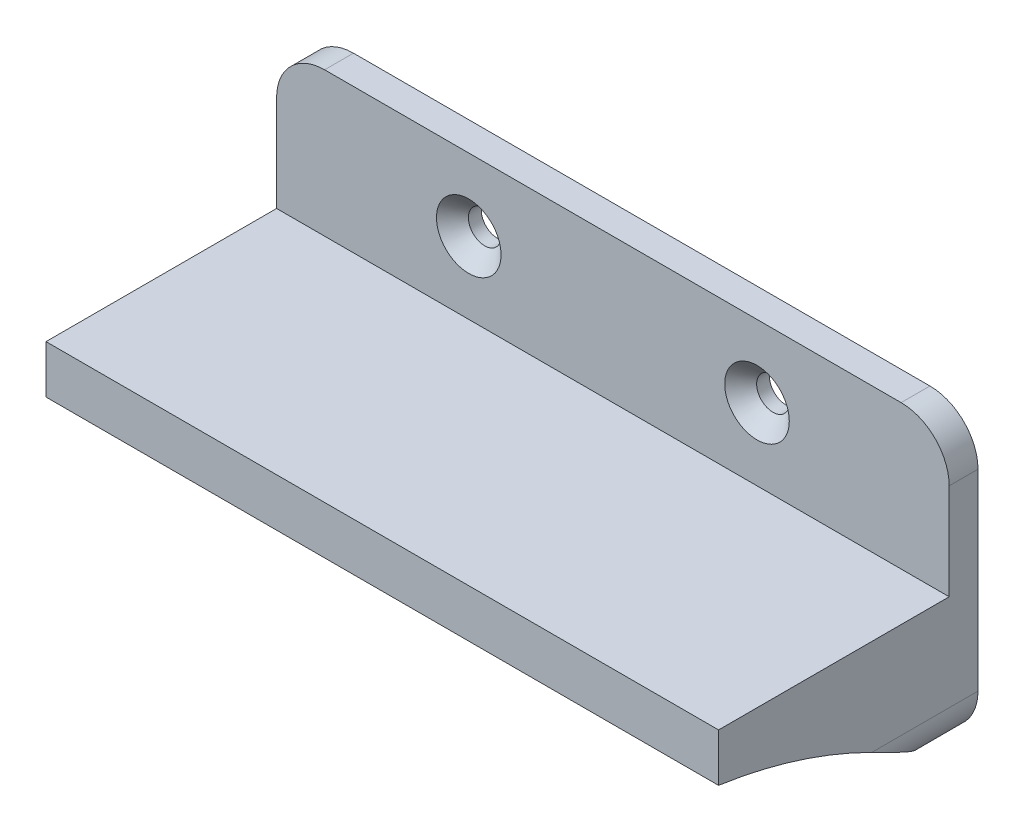
ISO-10303-21;
HEADER;
FILE_DESCRIPTION(('STEP AP214'),'2;1');
FILE_NAME('part.step','',(''),(''),'','','');
FILE_SCHEMA(('AUTOMOTIVE_DESIGN { 1 0 10303 214 1 1 1 1 }'));
ENDSEC;
DATA;
#1=APPLICATION_CONTEXT('core data for automotive mechanical design processes');
#2=APPLICATION_PROTOCOL_DEFINITION('international standard','automotive_design',2000,#1);
#3=PRODUCT_CONTEXT('',#1,'mechanical');
#4=PRODUCT('Part','Part','',(#3));
#5=PRODUCT_RELATED_PRODUCT_CATEGORY('part','',(#4));
#6=PRODUCT_DEFINITION_FORMATION('','',#4);
#7=PRODUCT_DEFINITION_CONTEXT('part definition',#1,'design');
#8=PRODUCT_DEFINITION('design','',#6,#7);
#9=PRODUCT_DEFINITION_SHAPE('','',#8);
#10=(LENGTH_UNIT() NAMED_UNIT(*) SI_UNIT(.MILLI.,.METRE.));
#11=(NAMED_UNIT(*) PLANE_ANGLE_UNIT() SI_UNIT($,.RADIAN.));
#12=(NAMED_UNIT(*) SI_UNIT($,.STERADIAN.) SOLID_ANGLE_UNIT());
#13=UNCERTAINTY_MEASURE_WITH_UNIT(LENGTH_MEASURE(1.E-05),#10,'distance_accuracy_value','');
#14=(GEOMETRIC_REPRESENTATION_CONTEXT(3) GLOBAL_UNCERTAINTY_ASSIGNED_CONTEXT((#13)) GLOBAL_UNIT_ASSIGNED_CONTEXT((#10,
#11,#12)) REPRESENTATION_CONTEXT('',''));
#15=CARTESIAN_POINT('',(0.,0.,0.));
#16=DIRECTION('',(0.,0.,1.));
#17=DIRECTION('',(1.,0.,0.));
#18=AXIS2_PLACEMENT_3D('',#15,#16,#17);
#19=CARTESIAN_POINT('',(0.,0.,3.));
#20=DIRECTION('',(0.,0.,1.));
#21=DIRECTION('',(1.,0.,0.));
#22=AXIS2_PLACEMENT_3D('',#19,#20,#21);
#23=PLANE('',#22);
#24=CARTESIAN_POINT('',(-9.92366412213741,7.99618320610687,3.));
#25=DIRECTION('',(0.,0.,1.));
#26=DIRECTION('',(1.,0.,0.));
#27=AXIS2_PLACEMENT_3D('',#24,#25,#26);
#28=CIRCLE('',#27,3.36);
#29=CARTESIAN_POINT('',(-6.56366412213741,7.99618320610687,3.));
#30=VERTEX_POINT('',#29);
#31=EDGE_CURVE('E479',#30,#30,#28,.T.);
#32=ORIENTED_EDGE('',*,*,#31,.F.);
#33=EDGE_LOOP('',(#32));
#34=FACE_BOUND('',#33,.T.);
#35=CARTESIAN_POINT('',(20.0763358778626,7.99618320610689,3.));
#36=DIRECTION('',(0.,0.,1.));
#37=DIRECTION('',(1.,0.,0.));
#38=AXIS2_PLACEMENT_3D('',#35,#36,#37);
#39=CIRCLE('',#38,3.36);
#40=CARTESIAN_POINT('',(23.4363358778626,7.99618320610689,3.));
#41=VERTEX_POINT('',#40);
#42=EDGE_CURVE('E470',#41,#41,#39,.T.);
#43=ORIENTED_EDGE('',*,*,#42,.F.);
#44=EDGE_LOOP('',(#43));
#45=FACE_BOUND('',#44,.T.);
#46=DIRECTION('',(0.,1.,0.));
#47=VECTOR('',#46,1.);
#48=CARTESIAN_POINT('',(40.0763358778626,15.4961832061069,3.));
#49=LINE('',#48,#47);
#50=CARTESIAN_POINT('',(40.0763358778626,0.496183206106872,3.));
#51=VERTEX_POINT('',#50);
#52=CARTESIAN_POINT('',(40.0763358778626,10.4961832061069,3.));
#53=VERTEX_POINT('',#52);
#54=EDGE_CURVE('E283',#51,#53,#49,.T.);
#55=ORIENTED_EDGE('',*,*,#54,.T.);
#56=CARTESIAN_POINT('',(35.0763358778626,10.4961832061069,3.));
#57=DIRECTION('',(0.,0.,1.));
#58=DIRECTION('',(1.,0.,0.));
#59=AXIS2_PLACEMENT_3D('',#56,#57,#58);
#60=CIRCLE('',#59,5.);
#61=CARTESIAN_POINT('',(35.0763358778626,15.4961832061069,3.));
#62=VERTEX_POINT('',#61);
#63=EDGE_CURVE('E11',#53,#62,#60,.T.);
#64=ORIENTED_EDGE('',*,*,#63,.T.);
#65=DIRECTION('',(-1.,0.,0.));
#66=VECTOR('',#65,1.);
#67=CARTESIAN_POINT('',(-29.9236641221374,15.4961832061069,3.));
#68=LINE('',#67,#66);
#69=CARTESIAN_POINT('',(-24.9236641221374,15.4961832061069,3.));
#70=VERTEX_POINT('',#69);
#71=EDGE_CURVE('E188',#62,#70,#68,.T.);
#72=ORIENTED_EDGE('',*,*,#71,.T.);
#73=CARTESIAN_POINT('',(-24.9236641221374,10.4961832061069,3.));
#74=DIRECTION('',(0.,0.,1.));
#75=DIRECTION('',(1.,0.,0.));
#76=AXIS2_PLACEMENT_3D('',#73,#74,#75);
#77=CIRCLE('',#76,5.);
#78=CARTESIAN_POINT('',(-29.9236641221374,10.4961832061069,3.));
#79=VERTEX_POINT('',#78);
#80=EDGE_CURVE('E41',#70,#79,#77,.T.);
#81=ORIENTED_EDGE('',*,*,#80,.T.);
#82=DIRECTION('',(0.,-1.,0.));
#83=VECTOR('',#82,1.);
#84=CARTESIAN_POINT('',(-29.9236641221374,15.4961832061069,3.));
#85=LINE('',#84,#83);
#86=CARTESIAN_POINT('',(-29.9236641221374,0.496183206106872,3.));
#87=VERTEX_POINT('',#86);
#88=EDGE_CURVE('E275',#79,#87,#85,.T.);
#89=ORIENTED_EDGE('',*,*,#88,.T.);
#90=DIRECTION('',(-1.,0.,0.));
#91=VECTOR('',#90,1.);
#92=CARTESIAN_POINT('',(-29.9236641221374,0.496183206106873,3.));
#93=LINE('',#92,#91);
#94=EDGE_CURVE('E208',#51,#87,#93,.T.);
#95=ORIENTED_EDGE('',*,*,#94,.F.);
#96=EDGE_LOOP('',(#55,#64,#72,#81,#89,#95));
#97=FACE_BOUND('',#96,.T.);
#98=ADVANCED_FACE('F33',(#34,#45,#97),#23,.T.);
#99=CARTESIAN_POINT('',(27.0763358778626,-9.50381679389311,3.));
#100=DIRECTION('',(0.,0.,1.));
#101=DIRECTION('',(1.,0.,0.));
#102=AXIS2_PLACEMENT_3D('',#99,#100,#101);
#103=CIRCLE('',#102,3.36);
#104=CARTESIAN_POINT('',(30.4363358778626,-9.50381679389311,3.));
#105=VERTEX_POINT('',#104);
#106=EDGE_CURVE('E452',#105,#105,#103,.T.);
#107=ORIENTED_EDGE('',*,*,#106,.F.);
#108=EDGE_LOOP('',(#107));
#109=FACE_BOUND('',#108,.T.);
#110=DIRECTION('',(1.,0.,0.));
#111=VECTOR('',#110,1.);
#112=CARTESIAN_POINT('',(-29.9236641221374,-14.5038167938931,3.));
#113=LINE('',#112,#111);
#114=CARTESIAN_POINT('',(18.0763358778626,-14.5038167938931,3.00000000000001));
#115=VERTEX_POINT('',#114);
#116=CARTESIAN_POINT('',(35.0763358778626,-14.5038167938931,3.));
#117=VERTEX_POINT('',#116);
#118=EDGE_CURVE('E277',#115,#117,#113,.T.);
#119=ORIENTED_EDGE('',*,*,#118,.T.);
#120=CARTESIAN_POINT('',(35.0763358778626,-9.50381679389312,3.));
#121=DIRECTION('',(0.,0.,1.));
#122=DIRECTION('',(1.,0.,0.));
#123=AXIS2_PLACEMENT_3D('',#120,#121,#122);
#124=CIRCLE('',#123,5.);
#125=CARTESIAN_POINT('',(36.0763358778626,-14.4027962794595,3.));
#126=VERTEX_POINT('',#125);
#127=EDGE_CURVE('E312',#117,#126,#124,.T.);
#128=ORIENTED_EDGE('',*,*,#127,.T.);
#129=DIRECTION('',(0.,-1.,0.));
#130=VECTOR('',#129,1.);
#131=CARTESIAN_POINT('',(36.0763358778626,-4.50381679389313,3.));
#132=LINE('',#131,#130);
#133=CARTESIAN_POINT('',(36.0763358778626,-4.50381679389313,3.));
#134=VERTEX_POINT('',#133);
#135=EDGE_CURVE('E213',#134,#126,#132,.T.);
#136=ORIENTED_EDGE('',*,*,#135,.F.);
#137=DIRECTION('',(1.,0.,0.));
#138=VECTOR('',#137,1.);
#139=CARTESIAN_POINT('',(18.0763358778626,-4.50381679389313,3.));
#140=LINE('',#139,#138);
#141=CARTESIAN_POINT('',(18.0763358778626,-4.50381679389313,3.));
#142=VERTEX_POINT('',#141);
#143=EDGE_CURVE('E247',#142,#134,#140,.T.);
#144=ORIENTED_EDGE('',*,*,#143,.F.);
#145=DIRECTION('',(0.,1.,0.));
#146=VECTOR('',#145,1.);
#147=CARTESIAN_POINT('',(18.0763358778626,-4.50381679389313,3.));
#148=LINE('',#147,#146);
#149=EDGE_CURVE('E244',#115,#142,#148,.T.);
#150=ORIENTED_EDGE('',*,*,#149,.F.);
#151=EDGE_LOOP('',(#119,#128,#136,#144,#150));
#152=FACE_BOUND('',#151,.T.);
#153=ADVANCED_FACE('F361',(#109,#152),#23,.T.);
#154=DIRECTION('',(0.,-1.,0.));
#155=VECTOR('',#154,1.);
#156=CARTESIAN_POINT('',(14.0763358778626,-4.50381679389313,3.));
#157=LINE('',#156,#155);
#158=CARTESIAN_POINT('',(14.0763358778626,-4.50381679389313,3.));
#159=VERTEX_POINT('',#158);
#160=CARTESIAN_POINT('',(14.0763358778626,-14.5038167938931,3.00000000000001));
#161=VERTEX_POINT('',#160);
#162=EDGE_CURVE('E241',#159,#161,#157,.T.);
#163=ORIENTED_EDGE('',*,*,#162,.F.);
#164=DIRECTION('',(1.,0.,0.));
#165=VECTOR('',#164,1.);
#166=CARTESIAN_POINT('',(-3.92366412213741,-4.50381679389313,3.));
#167=LINE('',#166,#165);
#168=CARTESIAN_POINT('',(-3.92366412213741,-4.50381679389313,3.));
#169=VERTEX_POINT('',#168);
#170=EDGE_CURVE('E238',#169,#159,#167,.T.);
#171=ORIENTED_EDGE('',*,*,#170,.F.);
#172=DIRECTION('',(0.,1.,0.));
#173=VECTOR('',#172,1.);
#174=CARTESIAN_POINT('',(-3.92366412213741,-4.50381679389313,3.));
#175=LINE('',#174,#173);
#176=CARTESIAN_POINT('',(-3.92366412213741,-14.5038167938931,3.00000000000001));
#177=VERTEX_POINT('',#176);
#178=EDGE_CURVE('E235',#177,#169,#175,.T.);
#179=ORIENTED_EDGE('',*,*,#178,.F.);
#180=EDGE_CURVE('E281',#177,#161,#113,.T.);
#181=ORIENTED_EDGE('',*,*,#180,.T.);
#182=EDGE_LOOP('',(#163,#171,#179,#181));
#183=FACE_BOUND('',#182,.T.);
#184=ADVANCED_FACE('F368',(#183),#23,.T.);
#185=CARTESIAN_POINT('',(-29.9236641221374,15.4961832061069,3.));
#186=DIRECTION('',(1.,0.,0.));
#187=DIRECTION('',(0.,0.,-1.));
#188=AXIS2_PLACEMENT_3D('',#185,#186,#187);
#189=PLANE('',#188);
#190=DIRECTION('',(0.,-1.,0.));
#191=VECTOR('',#190,1.);
#192=CARTESIAN_POINT('',(-29.9236641221374,15.4961832061069,0.));
#193=LINE('',#192,#191);
#194=CARTESIAN_POINT('',(-29.9236641221374,10.4961832061069,0.));
#195=VERTEX_POINT('',#194);
#196=CARTESIAN_POINT('',(-29.9236641221374,-9.50381679389313,0.));
#197=VERTEX_POINT('',#196);
#198=EDGE_CURVE('E274',#195,#197,#193,.T.);
#199=ORIENTED_EDGE('',*,*,#198,.T.);
#200=DIRECTION('',(0.,0.,-1.));
#201=VECTOR('',#200,1.);
#202=CARTESIAN_POINT('',(-29.9236641221374,-9.50381679389313,3.));
#203=LINE('',#202,#201);
#204=CARTESIAN_POINT('',(-29.9236641221374,-9.50381679389313,11.0521277313624));
#205=VERTEX_POINT('',#204);
#206=EDGE_CURVE('E198',#197,#205,#203,.F.);
#207=ORIENTED_EDGE('',*,*,#206,.T.);
#208=CARTESIAN_POINT('',(-29.9236641221374,-56.1358132044966,34.4299985044181));
#209=DIRECTION('',(-1.,0.,0.));
#210=DIRECTION('',(0.,0.,-1.));
#211=AXIS2_PLACEMENT_3D('',#208,#209,#210);
#212=CIRCLE('',#211,52.1638565591179);
#213=CARTESIAN_POINT('',(-29.9236641221374,-4.50381679389313,27.));
#214=VERTEX_POINT('',#213);
#215=EDGE_CURVE('E179',#214,#205,#212,.T.);
#216=ORIENTED_EDGE('',*,*,#215,.F.);
#217=DIRECTION('',(0.,-1.,0.));
#218=VECTOR('',#217,1.);
#219=CARTESIAN_POINT('',(-29.9236641221374,0.496183206106873,27.));
#220=LINE('',#219,#218);
#221=CARTESIAN_POINT('',(-29.9236641221374,0.496183206106873,27.));
#222=VERTEX_POINT('',#221);
#223=EDGE_CURVE('E196',#222,#214,#220,.T.);
#224=ORIENTED_EDGE('',*,*,#223,.F.);
#225=DIRECTION('',(0.,0.,-1.));
#226=VECTOR('',#225,1.);
#227=CARTESIAN_POINT('',(-29.9236641221374,0.496183206106873,27.));
#228=LINE('',#227,#226);
#229=EDGE_CURVE('E226',#222,#87,#228,.T.);
#230=ORIENTED_EDGE('',*,*,#229,.T.);
#231=ORIENTED_EDGE('',*,*,#88,.F.);
#232=DIRECTION('',(0.,0.,-1.));
#233=VECTOR('',#232,1.);
#234=CARTESIAN_POINT('',(-29.9236641221374,10.4961832061069,3.));
#235=LINE('',#234,#233);
#236=EDGE_CURVE('E324',#79,#195,#235,.T.);
#237=ORIENTED_EDGE('',*,*,#236,.T.);
#238=EDGE_LOOP('',(#199,#207,#216,#224,#230,#231,#237));
#239=FACE_BOUND('',#238,.T.);
#240=ADVANCED_FACE('F194',(#239),#189,.F.);
#241=CARTESIAN_POINT('',(-29.9236641221374,-14.5038167938931,3.));
#242=DIRECTION('',(0.,1.,0.));
#243=DIRECTION('',(0.,0.,1.));
#244=AXIS2_PLACEMENT_3D('',#241,#242,#243);
#245=PLANE('',#244);
#246=DIRECTION('',(1.,0.,0.));
#247=VECTOR('',#246,1.);
#248=CARTESIAN_POINT('',(-29.9236641221374,-14.5038167938931,0.));
#249=LINE('',#248,#247);
#250=CARTESIAN_POINT('',(-24.9236641221374,-14.5038167938931,0.));
#251=VERTEX_POINT('',#250);
#252=CARTESIAN_POINT('',(35.0763358778626,-14.5038167938931,0.));
#253=VERTEX_POINT('',#252);
#254=EDGE_CURVE('E287',#251,#253,#249,.T.);
#255=ORIENTED_EDGE('',*,*,#254,.T.);
#256=DIRECTION('',(0.,0.,-1.));
#257=VECTOR('',#256,1.);
#258=CARTESIAN_POINT('',(35.0763358778626,-14.5038167938931,3.));
#259=LINE('',#258,#257);
#260=EDGE_CURVE('E310',#253,#117,#259,.F.);
#261=ORIENTED_EDGE('',*,*,#260,.T.);
#262=ORIENTED_EDGE('',*,*,#118,.F.);
#263=DIRECTION('',(-1.,0.,0.));
#264=VECTOR('',#263,1.);
#265=CARTESIAN_POINT('',(40.0763358778626,-14.5038167938931,3.00000000000001));
#266=LINE('',#265,#264);
#267=EDGE_CURVE('E427',#115,#161,#266,.T.);
#268=ORIENTED_EDGE('',*,*,#267,.T.);
#269=ORIENTED_EDGE('',*,*,#180,.F.);
#270=CARTESIAN_POINT('',(-7.92366412213741,-14.5038167938931,3.00000000000001));
#271=VERTEX_POINT('',#270);
#272=EDGE_CURVE('E425',#177,#271,#266,.T.);
#273=ORIENTED_EDGE('',*,*,#272,.T.);
#274=CARTESIAN_POINT('',(-24.9236641221374,-14.5038167938931,3.));
#275=VERTEX_POINT('',#274);
#276=EDGE_CURVE('E282',#275,#271,#113,.T.);
#277=ORIENTED_EDGE('',*,*,#276,.F.);
#278=DIRECTION('',(0.,0.,-1.));
#279=VECTOR('',#278,1.);
#280=CARTESIAN_POINT('',(-24.9236641221374,-14.5038167938931,3.));
#281=LINE('',#280,#279);
#282=EDGE_CURVE('E307',#275,#251,#281,.T.);
#283=ORIENTED_EDGE('',*,*,#282,.T.);
#284=EDGE_LOOP('',(#255,#261,#262,#268,#269,#273,#277,#283));
#285=FACE_BOUND('',#284,.T.);
#286=ADVANCED_FACE('F393',(#285),#245,.F.);
#287=CARTESIAN_POINT('',(40.0763358778626,15.4961832061069,3.));
#288=DIRECTION('',(-1.,0.,0.));
#289=DIRECTION('',(0.,-1.,0.));
#290=AXIS2_PLACEMENT_3D('',#287,#288,#289);
#291=PLANE('',#290);
#292=CARTESIAN_POINT('',(40.0763358778626,-56.1358132044966,34.4299985044181));
#293=DIRECTION('',(-1.,0.,0.));
#294=DIRECTION('',(0.,0.,-1.));
#295=AXIS2_PLACEMENT_3D('',#292,#293,#294);
#296=CIRCLE('',#295,52.1638565591179);
#297=CARTESIAN_POINT('',(40.0763358778626,-4.50381679389313,27.));
#298=VERTEX_POINT('',#297);
#299=CARTESIAN_POINT('',(40.0763358778626,-9.50381679389312,11.0521277313625));
#300=VERTEX_POINT('',#299);
#301=EDGE_CURVE('E199',#298,#300,#296,.T.);
#302=ORIENTED_EDGE('',*,*,#301,.T.);
#303=DIRECTION('',(0.,0.,-1.));
#304=VECTOR('',#303,1.);
#305=CARTESIAN_POINT('',(40.0763358778626,-9.50381679389312,3.));
#306=LINE('',#305,#304);
#307=CARTESIAN_POINT('',(40.0763358778626,-9.50381679389312,0.));
#308=VERTEX_POINT('',#307);
#309=EDGE_CURVE('E296',#300,#308,#306,.T.);
#310=ORIENTED_EDGE('',*,*,#309,.T.);
#311=DIRECTION('',(0.,1.,0.));
#312=VECTOR('',#311,1.);
#313=CARTESIAN_POINT('',(40.0763358778626,15.4961832061069,0.));
#314=LINE('',#313,#312);
#315=CARTESIAN_POINT('',(40.0763358778626,10.4961832061069,0.));
#316=VERTEX_POINT('',#315);
#317=EDGE_CURVE('E290',#308,#316,#314,.T.);
#318=ORIENTED_EDGE('',*,*,#317,.T.);
#319=DIRECTION('',(0.,0.,-1.));
#320=VECTOR('',#319,1.);
#321=CARTESIAN_POINT('',(40.0763358778626,10.4961832061069,3.));
#322=LINE('',#321,#320);
#323=EDGE_CURVE('E294',#316,#53,#322,.F.);
#324=ORIENTED_EDGE('',*,*,#323,.T.);
#325=ORIENTED_EDGE('',*,*,#54,.F.);
#326=DIRECTION('',(0.,0.,-1.));
#327=VECTOR('',#326,1.);
#328=CARTESIAN_POINT('',(40.0763358778626,0.496183206106873,27.));
#329=LINE('',#328,#327);
#330=CARTESIAN_POINT('',(40.0763358778626,0.496183206106873,27.));
#331=VERTEX_POINT('',#330);
#332=EDGE_CURVE('E253',#331,#51,#329,.T.);
#333=ORIENTED_EDGE('',*,*,#332,.F.);
#334=DIRECTION('',(0.,1.,0.));
#335=VECTOR('',#334,1.);
#336=CARTESIAN_POINT('',(40.0763358778626,-4.50381679389313,27.));
#337=LINE('',#336,#335);
#338=EDGE_CURVE('E223',#298,#331,#337,.T.);
#339=ORIENTED_EDGE('',*,*,#338,.F.);
#340=EDGE_LOOP('',(#302,#310,#318,#324,#325,#333,#339));
#341=FACE_BOUND('',#340,.T.);
#342=ADVANCED_FACE('F384',(#341),#291,.F.);
#343=CARTESIAN_POINT('',(-29.9236641221374,15.4961832061069,3.));
#344=DIRECTION('',(0.,-1.,0.));
#345=DIRECTION('',(0.,0.,-1.));
#346=AXIS2_PLACEMENT_3D('',#343,#344,#345);
#347=PLANE('',#346);
#348=ORIENTED_EDGE('',*,*,#71,.F.);
#349=DIRECTION('',(0.,0.,-1.));
#350=VECTOR('',#349,1.);
#351=CARTESIAN_POINT('',(35.0763358778626,15.4961832061069,3.));
#352=LINE('',#351,#350);
#353=CARTESIAN_POINT('',(35.0763358778626,15.4961832061069,0.));
#354=VERTEX_POINT('',#353);
#355=EDGE_CURVE('E814',#62,#354,#352,.T.);
#356=ORIENTED_EDGE('',*,*,#355,.T.);
#357=DIRECTION('',(-1.,0.,0.));
#358=VECTOR('',#357,1.);
#359=CARTESIAN_POINT('',(-29.9236641221374,15.4961832061069,0.));
#360=LINE('',#359,#358);
#361=CARTESIAN_POINT('',(-24.9236641221374,15.4961832061069,0.));
#362=VERTEX_POINT('',#361);
#363=EDGE_CURVE('E278',#354,#362,#360,.T.);
#364=ORIENTED_EDGE('',*,*,#363,.T.);
#365=DIRECTION('',(0.,0.,-1.));
#366=VECTOR('',#365,1.);
#367=CARTESIAN_POINT('',(-24.9236641221374,15.4961832061069,3.));
#368=LINE('',#367,#366);
#369=EDGE_CURVE('E48',#362,#70,#368,.F.);
#370=ORIENTED_EDGE('',*,*,#369,.T.);
#371=EDGE_LOOP('',(#348,#356,#364,#370));
#372=FACE_BOUND('',#371,.T.);
#373=ADVANCED_FACE('F376',(#372),#347,.F.);
#374=CARTESIAN_POINT('',(-16.9236641221374,-9.50381679389313,3.));
#375=DIRECTION('',(0.,0.,1.));
#376=DIRECTION('',(1.,0.,0.));
#377=AXIS2_PLACEMENT_3D('',#374,#375,#376);
#378=CIRCLE('',#377,3.36);
#379=CARTESIAN_POINT('',(-13.5636641221374,-9.50381679389313,3.));
#380=VERTEX_POINT('',#379);
#381=EDGE_CURVE('E461',#380,#380,#378,.T.);
#382=ORIENTED_EDGE('',*,*,#381,.F.);
#383=EDGE_LOOP('',(#382));
#384=FACE_BOUND('',#383,.T.);
#385=DIRECTION('',(0.,1.,0.));
#386=VECTOR('',#385,1.);
#387=CARTESIAN_POINT('',(-25.9236641221374,-4.50381679389313,3.));
#388=LINE('',#387,#386);
#389=CARTESIAN_POINT('',(-25.9236641221374,-14.4027962794595,3.));
#390=VERTEX_POINT('',#389);
#391=CARTESIAN_POINT('',(-25.9236641221374,-4.50381679389313,3.));
#392=VERTEX_POINT('',#391);
#393=EDGE_CURVE('E227',#390,#392,#388,.T.);
#394=ORIENTED_EDGE('',*,*,#393,.F.);
#395=CARTESIAN_POINT('',(-24.9236641221374,-9.50381679389313,3.));
#396=DIRECTION('',(0.,0.,1.));
#397=DIRECTION('',(1.,0.,0.));
#398=AXIS2_PLACEMENT_3D('',#395,#396,#397);
#399=CIRCLE('',#398,5.);
#400=EDGE_CURVE('E431',#390,#275,#399,.T.);
#401=ORIENTED_EDGE('',*,*,#400,.T.);
#402=ORIENTED_EDGE('',*,*,#276,.T.);
#403=DIRECTION('',(0.,-1.,0.));
#404=VECTOR('',#403,1.);
#405=CARTESIAN_POINT('',(-7.92366412213741,-4.50381679389313,3.));
#406=LINE('',#405,#404);
#407=CARTESIAN_POINT('',(-7.92366412213741,-4.50381679389313,3.));
#408=VERTEX_POINT('',#407);
#409=EDGE_CURVE('E232',#408,#271,#406,.T.);
#410=ORIENTED_EDGE('',*,*,#409,.F.);
#411=DIRECTION('',(1.,0.,0.));
#412=VECTOR('',#411,1.);
#413=CARTESIAN_POINT('',(-25.9236641221374,-4.50381679389313,3.));
#414=LINE('',#413,#412);
#415=EDGE_CURVE('E229',#392,#408,#414,.T.);
#416=ORIENTED_EDGE('',*,*,#415,.F.);
#417=EDGE_LOOP('',(#394,#401,#402,#410,#416));
#418=FACE_BOUND('',#417,.T.);
#419=ADVANCED_FACE('F364',(#384,#418),#23,.T.);
#420=CARTESIAN_POINT('',(0.,0.,0.));
#421=DIRECTION('',(0.,0.,1.));
#422=DIRECTION('',(1.,0.,0.));
#423=AXIS2_PLACEMENT_3D('',#420,#421,#422);
#424=PLANE('',#423);
#425=CARTESIAN_POINT('',(-9.92366412213741,7.99618320610687,0.));
#426=DIRECTION('',(0.,0.,1.));
#427=DIRECTION('',(1.,0.,0.));
#428=AXIS2_PLACEMENT_3D('',#425,#426,#427);
#429=CIRCLE('',#428,1.7);
#430=CARTESIAN_POINT('',(-8.22366412213741,7.99618320610687,0.));
#431=VERTEX_POINT('',#430);
#432=EDGE_CURVE('E473',#431,#431,#429,.T.);
#433=ORIENTED_EDGE('',*,*,#432,.T.);
#434=EDGE_LOOP('',(#433));
#435=FACE_BOUND('',#434,.T.);
#436=CARTESIAN_POINT('',(20.0763358778626,7.99618320610689,0.));
#437=DIRECTION('',(0.,0.,1.));
#438=DIRECTION('',(1.,0.,0.));
#439=AXIS2_PLACEMENT_3D('',#436,#437,#438);
#440=CIRCLE('',#439,1.7);
#441=CARTESIAN_POINT('',(21.7763358778626,7.99618320610689,0.));
#442=VERTEX_POINT('',#441);
#443=EDGE_CURVE('E464',#442,#442,#440,.T.);
#444=ORIENTED_EDGE('',*,*,#443,.T.);
#445=EDGE_LOOP('',(#444));
#446=FACE_BOUND('',#445,.T.);
#447=CARTESIAN_POINT('',(-16.9236641221374,-9.50381679389313,0.));
#448=DIRECTION('',(0.,0.,1.));
#449=DIRECTION('',(1.,0.,0.));
#450=AXIS2_PLACEMENT_3D('',#447,#448,#449);
#451=CIRCLE('',#450,1.7);
#452=CARTESIAN_POINT('',(-15.2236641221374,-9.50381679389313,0.));
#453=VERTEX_POINT('',#452);
#454=EDGE_CURVE('E455',#453,#453,#451,.T.);
#455=ORIENTED_EDGE('',*,*,#454,.T.);
#456=EDGE_LOOP('',(#455));
#457=FACE_BOUND('',#456,.T.);
#458=CARTESIAN_POINT('',(27.0763358778626,-9.50381679389311,0.));
#459=DIRECTION('',(0.,0.,1.));
#460=DIRECTION('',(1.,0.,0.));
#461=AXIS2_PLACEMENT_3D('',#458,#459,#460);
#462=CIRCLE('',#461,1.7);
#463=CARTESIAN_POINT('',(28.7763358778626,-9.50381679389311,0.));
#464=VERTEX_POINT('',#463);
#465=EDGE_CURVE('E200',#464,#464,#462,.T.);
#466=ORIENTED_EDGE('',*,*,#465,.T.);
#467=EDGE_LOOP('',(#466));
#468=FACE_BOUND('',#467,.T.);
#469=ORIENTED_EDGE('',*,*,#317,.F.);
#470=CARTESIAN_POINT('',(35.0763358778626,-9.50381679389312,0.));
#471=DIRECTION('',(0.,0.,1.));
#472=DIRECTION('',(1.,0.,0.));
#473=AXIS2_PLACEMENT_3D('',#470,#471,#472);
#474=CIRCLE('',#473,5.);
#475=EDGE_CURVE('E305',#308,#253,#474,.F.);
#476=ORIENTED_EDGE('',*,*,#475,.T.);
#477=ORIENTED_EDGE('',*,*,#254,.F.);
#478=CARTESIAN_POINT('',(-24.9236641221374,-9.50381679389313,0.));
#479=DIRECTION('',(0.,0.,1.));
#480=DIRECTION('',(1.,0.,0.));
#481=AXIS2_PLACEMENT_3D('',#478,#479,#480);
#482=CIRCLE('',#481,5.);
#483=EDGE_CURVE('E303',#251,#197,#482,.F.);
#484=ORIENTED_EDGE('',*,*,#483,.T.);
#485=ORIENTED_EDGE('',*,*,#198,.F.);
#486=CARTESIAN_POINT('',(-24.9236641221374,10.4961832061069,0.));
#487=DIRECTION('',(0.,0.,1.));
#488=DIRECTION('',(1.,0.,0.));
#489=AXIS2_PLACEMENT_3D('',#486,#487,#488);
#490=CIRCLE('',#489,5.);
#491=EDGE_CURVE('E299',#195,#362,#490,.F.);
#492=ORIENTED_EDGE('',*,*,#491,.T.);
#493=ORIENTED_EDGE('',*,*,#363,.F.);
#494=CARTESIAN_POINT('',(35.0763358778626,10.4961832061069,0.));
#495=DIRECTION('',(0.,0.,1.));
#496=DIRECTION('',(1.,0.,0.));
#497=AXIS2_PLACEMENT_3D('',#494,#495,#496);
#498=CIRCLE('',#497,5.);
#499=EDGE_CURVE('E301',#354,#316,#498,.F.);
#500=ORIENTED_EDGE('',*,*,#499,.T.);
#501=EDGE_LOOP('',(#469,#476,#477,#484,#485,#492,#493,#500));
#502=FACE_BOUND('',#501,.T.);
#503=ADVANCED_FACE('F375',(#435,#446,#457,#468,#502),#424,.F.);
#504=CARTESIAN_POINT('',(-25.9236641221374,-4.50381679389313,27.));
#505=DIRECTION('',(-1.,0.,0.));
#506=DIRECTION('',(0.,0.,1.));
#507=AXIS2_PLACEMENT_3D('',#504,#505,#506);
#508=PLANE('',#507);
#509=CARTESIAN_POINT('',(-25.9236641221374,-56.1358132044966,34.4299985044181));
#510=DIRECTION('',(-1.,0.,0.));
#511=DIRECTION('',(0.,0.,1.));
#512=AXIS2_PLACEMENT_3D('',#509,#510,#511);
#513=CIRCLE('',#512,52.1638565591179);
#514=CARTESIAN_POINT('',(-25.9236641221374,-4.50381679389313,27.));
#515=VERTEX_POINT('',#514);
#516=CARTESIAN_POINT('',(-25.9236641221374,-14.4027962794595,3.13426030486783));
#517=VERTEX_POINT('',#516);
#518=EDGE_CURVE('E182',#515,#517,#513,.T.);
#519=ORIENTED_EDGE('',*,*,#518,.T.);
#520=DIRECTION('',(0.,0.,-1.));
#521=VECTOR('',#520,1.);
#522=CARTESIAN_POINT('',(-25.9236641221374,-14.4027962794595,3.13426030486783));
#523=LINE('',#522,#521);
#524=EDGE_CURVE('E347',#517,#390,#523,.T.);
#525=ORIENTED_EDGE('',*,*,#524,.T.);
#526=ORIENTED_EDGE('',*,*,#393,.T.);
#527=DIRECTION('',(0.,0.,-1.));
#528=VECTOR('',#527,1.);
#529=CARTESIAN_POINT('',(-25.9236641221374,-4.50381679389313,27.));
#530=LINE('',#529,#528);
#531=EDGE_CURVE('E271',#515,#392,#530,.T.);
#532=ORIENTED_EDGE('',*,*,#531,.F.);
#533=EDGE_LOOP('',(#519,#525,#526,#532));
#534=FACE_BOUND('',#533,.T.);
#535=ADVANCED_FACE('F382',(#534),#508,.F.);
#536=CARTESIAN_POINT('',(-25.9236641221374,-4.50381679389313,27.));
#537=DIRECTION('',(0.,1.,0.));
#538=DIRECTION('',(0.,0.,1.));
#539=AXIS2_PLACEMENT_3D('',#536,#537,#538);
#540=PLANE('',#539);
#541=ORIENTED_EDGE('',*,*,#415,.T.);
#542=DIRECTION('',(0.,0.,-1.));
#543=VECTOR('',#542,1.);
#544=CARTESIAN_POINT('',(-7.92366412213741,-4.50381679389313,27.));
#545=LINE('',#544,#543);
#546=CARTESIAN_POINT('',(-7.92366412213741,-4.50381679389313,27.));
#547=VERTEX_POINT('',#546);
#548=EDGE_CURVE('E268',#547,#408,#545,.T.);
#549=ORIENTED_EDGE('',*,*,#548,.F.);
#550=DIRECTION('',(1.,0.,0.));
#551=VECTOR('',#550,1.);
#552=CARTESIAN_POINT('',(-25.9236641221374,-4.50381679389313,27.));
#553=LINE('',#552,#551);
#554=EDGE_CURVE('E207',#515,#547,#553,.T.);
#555=ORIENTED_EDGE('',*,*,#554,.F.);
#556=ORIENTED_EDGE('',*,*,#531,.T.);
#557=EDGE_LOOP('',(#541,#549,#555,#556));
#558=FACE_BOUND('',#557,.T.);
#559=ADVANCED_FACE('F608',(#558),#540,.F.);
#560=CARTESIAN_POINT('',(-7.92366412213741,-4.50381679389313,27.));
#561=DIRECTION('',(1.,0.,0.));
#562=DIRECTION('',(0.,0.,-1.));
#563=AXIS2_PLACEMENT_3D('',#560,#561,#562);
#564=PLANE('',#563);
#565=ORIENTED_EDGE('',*,*,#409,.T.);
#566=CARTESIAN_POINT('',(-7.92366412213741,-56.1358132044966,34.4299985044181));
#567=DIRECTION('',(1.,0.,0.));
#568=DIRECTION('',(0.,0.,-1.));
#569=AXIS2_PLACEMENT_3D('',#566,#567,#568);
#570=CIRCLE('',#569,52.1638565591179);
#571=EDGE_CURVE('E433',#271,#547,#570,.T.);
#572=ORIENTED_EDGE('',*,*,#571,.T.);
#573=ORIENTED_EDGE('',*,*,#548,.T.);
#574=EDGE_LOOP('',(#565,#572,#573));
#575=FACE_BOUND('',#574,.T.);
#576=ADVANCED_FACE('F601',(#575),#564,.F.);
#577=CARTESIAN_POINT('',(-3.92366412213741,-4.50381679389313,27.));
#578=DIRECTION('',(-1.,0.,0.));
#579=DIRECTION('',(0.,0.,1.));
#580=AXIS2_PLACEMENT_3D('',#577,#578,#579);
#581=PLANE('',#580);
#582=DIRECTION('',(0.,0.,-1.));
#583=VECTOR('',#582,1.);
#584=CARTESIAN_POINT('',(-3.92366412213741,-4.50381679389313,27.));
#585=LINE('',#584,#583);
#586=CARTESIAN_POINT('',(-3.92366412213741,-4.50381679389313,27.));
#587=VERTEX_POINT('',#586);
#588=EDGE_CURVE('E265',#587,#169,#585,.T.);
#589=ORIENTED_EDGE('',*,*,#588,.F.);
#590=CARTESIAN_POINT('',(-3.92366412213741,-56.1358132044966,34.4299985044181));
#591=DIRECTION('',(-1.,0.,0.));
#592=DIRECTION('',(0.,0.,1.));
#593=AXIS2_PLACEMENT_3D('',#590,#591,#592);
#594=CIRCLE('',#593,52.1638565591179);
#595=EDGE_CURVE('E408',#587,#177,#594,.T.);
#596=ORIENTED_EDGE('',*,*,#595,.T.);
#597=ORIENTED_EDGE('',*,*,#178,.T.);
#598=EDGE_LOOP('',(#589,#596,#597));
#599=FACE_BOUND('',#598,.T.);
#600=ADVANCED_FACE('F421',(#599),#581,.F.);
#601=CARTESIAN_POINT('',(-3.92366412213741,-4.50381679389313,27.));
#602=DIRECTION('',(0.,1.,0.));
#603=DIRECTION('',(0.,0.,1.));
#604=AXIS2_PLACEMENT_3D('',#601,#602,#603);
#605=PLANE('',#604);
#606=ORIENTED_EDGE('',*,*,#170,.T.);
#607=DIRECTION('',(0.,0.,-1.));
#608=VECTOR('',#607,1.);
#609=CARTESIAN_POINT('',(14.0763358778626,-4.50381679389313,27.));
#610=LINE('',#609,#608);
#611=CARTESIAN_POINT('',(14.0763358778626,-4.50381679389313,27.));
#612=VERTEX_POINT('',#611);
#613=EDGE_CURVE('E262',#612,#159,#610,.T.);
#614=ORIENTED_EDGE('',*,*,#613,.F.);
#615=DIRECTION('',(1.,0.,0.));
#616=VECTOR('',#615,1.);
#617=CARTESIAN_POINT('',(-3.92366412213741,-4.50381679389313,27.));
#618=LINE('',#617,#616);
#619=EDGE_CURVE('E210',#587,#612,#618,.T.);
#620=ORIENTED_EDGE('',*,*,#619,.F.);
#621=ORIENTED_EDGE('',*,*,#588,.T.);
#622=EDGE_LOOP('',(#606,#614,#620,#621));
#623=FACE_BOUND('',#622,.T.);
#624=ADVANCED_FACE('F401',(#623),#605,.F.);
#625=CARTESIAN_POINT('',(14.0763358778626,-4.50381679389313,27.));
#626=DIRECTION('',(1.,0.,0.));
#627=DIRECTION('',(0.,0.,-1.));
#628=AXIS2_PLACEMENT_3D('',#625,#626,#627);
#629=PLANE('',#628);
#630=ORIENTED_EDGE('',*,*,#162,.T.);
#631=CARTESIAN_POINT('',(14.0763358778626,-56.1358132044966,34.4299985044181));
#632=DIRECTION('',(1.,0.,0.));
#633=DIRECTION('',(0.,0.,-1.));
#634=AXIS2_PLACEMENT_3D('',#631,#632,#633);
#635=CIRCLE('',#634,52.1638565591179);
#636=EDGE_CURVE('E405',#161,#612,#635,.T.);
#637=ORIENTED_EDGE('',*,*,#636,.T.);
#638=ORIENTED_EDGE('',*,*,#613,.T.);
#639=EDGE_LOOP('',(#630,#637,#638));
#640=FACE_BOUND('',#639,.T.);
#641=ADVANCED_FACE('F404',(#640),#629,.F.);
#642=CARTESIAN_POINT('',(18.0763358778626,-4.50381679389313,27.));
#643=DIRECTION('',(-1.,0.,0.));
#644=DIRECTION('',(0.,0.,1.));
#645=AXIS2_PLACEMENT_3D('',#642,#643,#644);
#646=PLANE('',#645);
#647=DIRECTION('',(0.,0.,-1.));
#648=VECTOR('',#647,1.);
#649=CARTESIAN_POINT('',(18.0763358778626,-4.50381679389313,27.));
#650=LINE('',#649,#648);
#651=CARTESIAN_POINT('',(18.0763358778626,-4.50381679389313,27.));
#652=VERTEX_POINT('',#651);
#653=EDGE_CURVE('E259',#652,#142,#650,.T.);
#654=ORIENTED_EDGE('',*,*,#653,.F.);
#655=CARTESIAN_POINT('',(18.0763358778626,-56.1358132044966,34.4299985044181));
#656=DIRECTION('',(-1.,0.,0.));
#657=DIRECTION('',(0.,0.,1.));
#658=AXIS2_PLACEMENT_3D('',#655,#656,#657);
#659=CIRCLE('',#658,52.1638565591179);
#660=EDGE_CURVE('E409',#652,#115,#659,.T.);
#661=ORIENTED_EDGE('',*,*,#660,.T.);
#662=ORIENTED_EDGE('',*,*,#149,.T.);
#663=EDGE_LOOP('',(#654,#661,#662));
#664=FACE_BOUND('',#663,.T.);
#665=ADVANCED_FACE('F538',(#664),#646,.F.);
#666=CARTESIAN_POINT('',(18.0763358778626,-4.50381679389313,27.));
#667=DIRECTION('',(0.,1.,0.));
#668=DIRECTION('',(0.,0.,1.));
#669=AXIS2_PLACEMENT_3D('',#666,#667,#668);
#670=PLANE('',#669);
#671=ORIENTED_EDGE('',*,*,#143,.T.);
#672=DIRECTION('',(0.,0.,-1.));
#673=VECTOR('',#672,1.);
#674=CARTESIAN_POINT('',(36.0763358778626,-4.50381679389313,27.));
#675=LINE('',#674,#673);
#676=CARTESIAN_POINT('',(36.0763358778626,-4.50381679389313,27.));
#677=VERTEX_POINT('',#676);
#678=EDGE_CURVE('E256',#677,#134,#675,.T.);
#679=ORIENTED_EDGE('',*,*,#678,.F.);
#680=DIRECTION('',(1.,0.,0.));
#681=VECTOR('',#680,1.);
#682=CARTESIAN_POINT('',(18.0763358778626,-4.50381679389313,27.));
#683=LINE('',#682,#681);
#684=EDGE_CURVE('E220',#652,#677,#683,.T.);
#685=ORIENTED_EDGE('',*,*,#684,.F.);
#686=ORIENTED_EDGE('',*,*,#653,.T.);
#687=EDGE_LOOP('',(#671,#679,#685,#686));
#688=FACE_BOUND('',#687,.T.);
#689=ADVANCED_FACE('F536',(#688),#670,.F.);
#690=CARTESIAN_POINT('',(36.0763358778626,-4.50381679389313,27.));
#691=DIRECTION('',(1.,0.,0.));
#692=DIRECTION('',(0.,0.,-1.));
#693=AXIS2_PLACEMENT_3D('',#690,#691,#692);
#694=PLANE('',#693);
#695=ORIENTED_EDGE('',*,*,#135,.T.);
#696=DIRECTION('',(0.,0.,-1.));
#697=VECTOR('',#696,1.);
#698=CARTESIAN_POINT('',(36.0763358778626,-14.4027962794595,3.));
#699=LINE('',#698,#697);
#700=CARTESIAN_POINT('',(36.0763358778626,-14.4027962794595,3.13426030486784));
#701=VERTEX_POINT('',#700);
#702=EDGE_CURVE('E314',#126,#701,#699,.F.);
#703=ORIENTED_EDGE('',*,*,#702,.T.);
#704=CARTESIAN_POINT('',(36.0763358778626,-56.1358132044966,34.4299985044181));
#705=DIRECTION('',(1.,0.,0.));
#706=DIRECTION('',(0.,0.,-1.));
#707=AXIS2_PLACEMENT_3D('',#704,#705,#706);
#708=CIRCLE('',#707,52.1638565591179);
#709=EDGE_CURVE('E439',#701,#677,#708,.T.);
#710=ORIENTED_EDGE('',*,*,#709,.T.);
#711=ORIENTED_EDGE('',*,*,#678,.T.);
#712=EDGE_LOOP('',(#695,#703,#710,#711));
#713=FACE_BOUND('',#712,.T.);
#714=ADVANCED_FACE('F530',(#713),#694,.F.);
#715=CARTESIAN_POINT('',(-29.9236641221374,0.496183206106873,27.));
#716=DIRECTION('',(0.,-1.,0.));
#717=DIRECTION('',(0.,0.,-1.));
#718=AXIS2_PLACEMENT_3D('',#715,#716,#717);
#719=PLANE('',#718);
#720=ORIENTED_EDGE('',*,*,#94,.T.);
#721=ORIENTED_EDGE('',*,*,#229,.F.);
#722=DIRECTION('',(-1.,0.,0.));
#723=VECTOR('',#722,1.);
#724=CARTESIAN_POINT('',(-29.9236641221374,0.496183206106873,27.));
#725=LINE('',#724,#723);
#726=EDGE_CURVE('E205',#331,#222,#725,.T.);
#727=ORIENTED_EDGE('',*,*,#726,.F.);
#728=ORIENTED_EDGE('',*,*,#332,.T.);
#729=EDGE_LOOP('',(#720,#721,#727,#728));
#730=FACE_BOUND('',#729,.T.);
#731=ADVANCED_FACE('F559',(#730),#719,.F.);
#732=CARTESIAN_POINT('',(0.,0.,27.));
#733=DIRECTION('',(0.,0.,1.));
#734=DIRECTION('',(1.,0.,0.));
#735=AXIS2_PLACEMENT_3D('',#732,#733,#734);
#736=PLANE('',#735);
#737=DIRECTION('',(-1.,0.,0.));
#738=VECTOR('',#737,1.);
#739=CARTESIAN_POINT('',(40.0763358778626,-4.50381679389313,27.));
#740=LINE('',#739,#738);
#741=EDGE_CURVE('E441',#298,#677,#740,.T.);
#742=ORIENTED_EDGE('',*,*,#741,.F.);
#743=ORIENTED_EDGE('',*,*,#338,.T.);
#744=ORIENTED_EDGE('',*,*,#726,.T.);
#745=ORIENTED_EDGE('',*,*,#223,.T.);
#746=DIRECTION('',(-1.,0.,0.));
#747=VECTOR('',#746,1.);
#748=CARTESIAN_POINT('',(40.0763358778626,-4.50381679389313,27.));
#749=LINE('',#748,#747);
#750=EDGE_CURVE('E176',#515,#214,#749,.T.);
#751=ORIENTED_EDGE('',*,*,#750,.F.);
#752=ORIENTED_EDGE('',*,*,#554,.T.);
#753=EDGE_CURVE('E187',#587,#547,#749,.T.);
#754=ORIENTED_EDGE('',*,*,#753,.F.);
#755=ORIENTED_EDGE('',*,*,#619,.T.);
#756=EDGE_CURVE('E190',#652,#612,#749,.T.);
#757=ORIENTED_EDGE('',*,*,#756,.F.);
#758=ORIENTED_EDGE('',*,*,#684,.T.);
#759=EDGE_LOOP('',(#742,#743,#744,#745,#751,#752,#754,#755,#757,#758));
#760=FACE_BOUND('',#759,.T.);
#761=ADVANCED_FACE('F203',(#760),#736,.T.);
#762=CARTESIAN_POINT('',(40.0763358778626,-56.1358132044966,34.4299985044181));
#763=DIRECTION('',(-1.,0.,0.));
#764=DIRECTION('',(0.,0.,1.));
#765=AXIS2_PLACEMENT_3D('',#762,#763,#764);
#766=CYLINDRICAL_SURFACE('',#765,52.1638565591179);
#767=ORIENTED_EDGE('',*,*,#215,.T.);
#768=CARTESIAN_POINT('',(-29.9236641221374,-9.50381679389313,11.0521277313624));
#769=CARTESIAN_POINT('',(-29.9236552409525,-9.59785702571356,10.8645415266646));
#770=CARTESIAN_POINT('',(-29.9210102870231,-9.69303771105545,10.677512641665));
#771=CARTESIAN_POINT('',(-29.9100024782241,-9.88559797588627,10.304710865619));
#772=CARTESIAN_POINT('',(-29.9016383917616,-9.98297802463098,10.11893825381));
#773=CARTESIAN_POINT('',(-29.8787021932567,-10.1801926401378,9.74816023276062));
#774=CARTESIAN_POINT('',(-29.8641063460948,-10.2800352017751,9.56316051592007));
#775=CARTESIAN_POINT('',(-29.8281827628524,-10.4816638274344,9.19489126692268));
#776=CARTESIAN_POINT('',(-29.8068554678655,-10.5834497637019,9.01162162220903));
#777=CARTESIAN_POINT('',(-29.7567149483005,-10.7894826573236,8.64584461204367));
#778=CARTESIAN_POINT('',(-29.7278522501298,-10.8937415761438,8.46335070414016));
#779=CARTESIAN_POINT('',(-29.6620335702488,-11.1038075466773,8.10073160180696));
#780=CARTESIAN_POINT('',(-29.6250780730112,-11.209614505364,7.9206062662674));
#781=CARTESIAN_POINT('',(-29.5423639285985,-11.4223093026908,7.56340885632456));
#782=CARTESIAN_POINT('',(-29.4966188182348,-11.5291952428176,7.38633253728426));
#783=CARTESIAN_POINT('',(-29.3954219535354,-11.7437842036729,7.03551090869645));
#784=CARTESIAN_POINT('',(-29.3399724011329,-11.8514870337573,6.86176485341493));
#785=CARTESIAN_POINT('',(-29.2293954048893,-12.0476220364854,6.54941563688021));
#786=CARTESIAN_POINT('',(-29.1760352083595,-12.1360047836929,6.41015632510828));
#787=CARTESIAN_POINT('',(-29.0615124692757,-12.3126046229236,6.13475026310802));
#788=CARTESIAN_POINT('',(-29.0003496905171,-12.4008217098498,5.99860360725516));
#789=CARTESIAN_POINT('',(-28.8694326005799,-12.576755855976,5.72978427751965));
#790=CARTESIAN_POINT('',(-28.7996645615113,-12.6644718764102,5.59711757485702));
#791=CARTESIAN_POINT('',(-28.6508582327998,-12.8386549670721,5.33620848154109));
#792=CARTESIAN_POINT('',(-28.5718199667463,-12.9251220404772,5.20796607963064));
#793=CARTESIAN_POINT('',(-28.4025060213733,-13.0972036931135,4.95509862766442));
#794=CARTESIAN_POINT('',(-28.3120914110761,-13.1827904304925,4.83054705831307));
#795=CARTESIAN_POINT('',(-28.1199951856144,-13.3508618551672,4.58812158627054));
#796=CARTESIAN_POINT('',(-28.0183120956912,-13.433346134533,4.47024856068968));
#797=CARTESIAN_POINT('',(-27.8035958423402,-13.5932897827642,4.24356551412666));
#798=CARTESIAN_POINT('',(-27.6906483345765,-13.6707806536816,4.13469711996551));
#799=CARTESIAN_POINT('',(-27.4521143525409,-13.8196811227139,3.92706103245299));
#800=CARTESIAN_POINT('',(-27.3265332907147,-13.8910933010484,3.82828904987078));
#801=CARTESIAN_POINT('',(-27.1017435546274,-14.0056831540361,3.67082825966819));
#802=CARTESIAN_POINT('',(-27.0058144449179,-14.0509370302124,3.60896076035106));
#803=CARTESIAN_POINT('',(-26.8076838441007,-14.1365383416525,3.49241524001335));
#804=CARTESIAN_POINT('',(-26.7054873043308,-14.1768895767971,3.43773164826884));
#805=CARTESIAN_POINT('',(-26.4934206702453,-14.2523635846524,3.33580810881806));
#806=CARTESIAN_POINT('',(-26.383457255312,-14.2873971455383,3.28869452605437));
#807=CARTESIAN_POINT('',(-26.1577023710466,-14.3505673251957,3.20398479799276));
#808=CARTESIAN_POINT('',(-26.0418968612735,-14.3786862713589,3.16641303213767));
#809=CARTESIAN_POINT('',(-25.9236641221375,-14.4027962794595,3.13426030486779));
#810=B_SPLINE_CURVE_WITH_KNOTS('',3,(#768,#769,#770,#771,#772,#773,#774,#775,#776,#777,#778,
#779,#780,#781,#782,#783,#784,#785,#786,#787,#788,#789,#790,#791,#792,#793,#794,#795,#796,#797,
#798,#799,#800,#801,#802,#803,#804,#805,#806,#807,#808,#809),.UNSPECIFIED.,.F.,.F.,(4,2,2,2,2,2,
2,2,2,2,2,2,2,2,2,2,2,2,2,2,4),(0.,0.629513996030285,1.25916359815608,1.89123306702317,
2.52326112666215,3.15954793815204,3.79579666894396,4.43107326054561,5.06620589462491,
5.58609155791569,6.10599296324701,6.62673475826685,7.14747522821836,7.67533911650698,
8.20327217058414,8.72745919856806,9.25142260393588,9.61939164282239,9.98707363623427,
10.3603681069979,10.7346069651995),.UNSPECIFIED.);
#811=EDGE_CURVE('E341',#205,#517,#810,.T.);
#812=ORIENTED_EDGE('',*,*,#811,.T.);
#813=ORIENTED_EDGE('',*,*,#518,.F.);
#814=ORIENTED_EDGE('',*,*,#750,.T.);
#815=EDGE_LOOP('',(#767,#812,#813,#814));
#816=FACE_BOUND('',#815,.T.);
#817=ADVANCED_FACE('F178',(#816),#766,.F.);
#818=ORIENTED_EDGE('',*,*,#272,.F.);
#819=ORIENTED_EDGE('',*,*,#595,.F.);
#820=ORIENTED_EDGE('',*,*,#753,.T.);
#821=ORIENTED_EDGE('',*,*,#571,.F.);
#822=EDGE_LOOP('',(#818,#819,#820,#821));
#823=FACE_BOUND('',#822,.T.);
#824=ADVANCED_FACE('F334',(#823),#766,.F.);
#825=ORIENTED_EDGE('',*,*,#267,.F.);
#826=ORIENTED_EDGE('',*,*,#660,.F.);
#827=ORIENTED_EDGE('',*,*,#756,.T.);
#828=ORIENTED_EDGE('',*,*,#636,.F.);
#829=EDGE_LOOP('',(#825,#826,#827,#828));
#830=FACE_BOUND('',#829,.T.);
#831=ADVANCED_FACE('F539',(#830),#766,.F.);
#832=ORIENTED_EDGE('',*,*,#709,.F.);
#833=CARTESIAN_POINT('',(36.0763358778626,-14.4027962794595,3.13426030486784));
#834=CARTESIAN_POINT('',(36.1945359839282,-14.3786929537716,3.16640411852265));
#835=CARTESIAN_POINT('',(36.310310427882,-14.3505827989174,3.20396412123422));
#836=CARTESIAN_POINT('',(36.5360125808215,-14.2874320558352,3.28864763861625));
#837=CARTESIAN_POINT('',(36.6459540247089,-14.2524087569993,3.33574730264216));
#838=CARTESIAN_POINT('',(36.8580221460842,-14.176942331326,3.43766021340892));
#839=CARTESIAN_POINT('',(36.9602396579918,-14.1365860431995,3.49235045833902));
#840=CARTESIAN_POINT('',(37.1584062347639,-14.050973968451,3.60891030542329));
#841=CARTESIAN_POINT('',(37.2543506735496,-14.0057146299891,3.67078511454139));
#842=CARTESIAN_POINT('',(37.4646183692713,-13.8985309397696,3.81806866936167));
#843=CARTESIAN_POINT('',(37.5770073212081,-13.835383903059,3.9053495005951));
#844=CARTESIAN_POINT('',(37.7917078969297,-13.7041246602877,4.0880726917207));
#845=CARTESIAN_POINT('',(37.8940180733517,-13.6360117435384,4.18351622015135));
#846=CARTESIAN_POINT('',(38.1876984150535,-13.4252699587197,4.48110362297256));
#847=CARTESIAN_POINT('',(38.3645797018872,-13.2769010439016,4.69359956010558));
#848=CARTESIAN_POINT('',(38.6536428394516,-13.001633307626,5.09472659109516));
#849=CARTESIAN_POINT('',(38.7717296902491,-12.8760437075174,5.28016809865252));
#850=CARTESIAN_POINT('',(38.9883526056794,-12.6221449306463,5.66055559083711));
#851=CARTESIAN_POINT('',(39.0868760875789,-12.493834061957,5.85550759265552));
#852=CARTESIAN_POINT('',(39.2667942231749,-12.2360039028335,6.25321629148568));
#853=CARTESIAN_POINT('',(39.3481376972049,-12.1064821694941,6.45599423767541));
#854=CARTESIAN_POINT('',(39.495366501295,-11.847810032306,6.86734638057797));
#855=CARTESIAN_POINT('',(39.5612472214997,-11.7186597505029,7.07592228514041));
#856=CARTESIAN_POINT('',(39.7050158419893,-11.4055615422726,7.58976293569927));
#857=CARTESIAN_POINT('',(39.7755929457662,-11.2223011376517,7.8974928089084));
#858=CARTESIAN_POINT('',(39.8926053933293,-10.8601907913937,8.52023359166104));
#859=CARTESIAN_POINT('',(39.939021843146,-10.6813444053751,8.83524999892678));
#860=CARTESIAN_POINT('',(40.0103744067084,-10.3323298097154,9.46529759705056));
#861=CARTESIAN_POINT('',(40.0356650098686,-10.1620654036151,9.78023601485992));
#862=CARTESIAN_POINT('',(40.0603937695725,-9.9114740889997,10.2554162203643));
#863=CARTESIAN_POINT('',(40.0664359785066,-9.82881613785082,10.4141288962527));
#864=CARTESIAN_POINT('',(40.0744050641202,-9.66510367998867,10.732464501363));
#865=CARTESIAN_POINT('',(40.0763323195502,-9.58404902638441,10.8920873454546));
#866=CARTESIAN_POINT('',(40.0763358778626,-9.50381679389312,11.0521277313625));
#867=B_SPLINE_CURVE_WITH_KNOTS('',3,(#833,#834,#835,#836,#837,#838,#839,#840,#841,#842,#843,
#844,#845,#846,#847,#848,#849,#850,#851,#852,#853,#854,#855,#856,#857,#858,#859,#860,#861,#862,
#863,#864,#865,#866),.UNSPECIFIED.,.F.,.F.,(4,2,2,2,2,2,2,2,2,2,2,2,2,2,2,2,4),(0.,
0.374136191445585,0.747348281073362,1.11509736220786,1.48311465037578,1.9494112166289,
2.41577464809556,3.3534538978198,4.11210667077401,4.87124582331587,5.63261552946625,
6.39421193254723,7.48823727883443,8.58311688775689,9.6592328661722,10.1963333948519,
10.7333844853513),.UNSPECIFIED.);
#868=EDGE_CURVE('E316',#701,#300,#867,.T.);
#869=ORIENTED_EDGE('',*,*,#868,.T.);
#870=ORIENTED_EDGE('',*,*,#301,.F.);
#871=ORIENTED_EDGE('',*,*,#741,.T.);
#872=EDGE_LOOP('',(#832,#869,#870,#871));
#873=FACE_BOUND('',#872,.T.);
#874=ADVANCED_FACE('F335',(#873),#766,.F.);
#875=CARTESIAN_POINT('',(27.0763358778626,-9.50381679389311,3.));
#876=DIRECTION('',(0.,0.,1.));
#877=DIRECTION('',(1.,0.,0.));
#878=AXIS2_PLACEMENT_3D('',#875,#876,#877);
#879=CYLINDRICAL_SURFACE('',#878,1.7);
#880=ORIENTED_EDGE('',*,*,#465,.F.);
#881=EDGE_LOOP('',(#880));
#882=FACE_BOUND('',#881,.T.);
#883=CARTESIAN_POINT('',(27.0763358778626,-9.50381679389311,1.34));
#884=DIRECTION('',(0.,0.,1.));
#885=DIRECTION('',(1.,0.,0.));
#886=AXIS2_PLACEMENT_3D('',#883,#884,#885);
#887=CIRCLE('',#886,1.7);
#888=CARTESIAN_POINT('',(28.7763358778626,-9.50381679389311,1.34));
#889=VERTEX_POINT('',#888);
#890=EDGE_CURVE('E449',#889,#889,#887,.T.);
#891=ORIENTED_EDGE('',*,*,#890,.T.);
#892=EDGE_LOOP('',(#891));
#893=FACE_BOUND('',#892,.T.);
#894=ADVANCED_FACE('F336',(#882,#893),#879,.F.);
#895=CARTESIAN_POINT('',(27.0763358778626,-9.50381679389311,3.));
#896=DIRECTION('',(0.,0.,1.));
#897=DIRECTION('',(1.,0.,0.));
#898=AXIS2_PLACEMENT_3D('',#895,#896,#897);
#899=CONICAL_SURFACE('',#898,3.36,0.785398163397448);
#900=ORIENTED_EDGE('',*,*,#890,.F.);
#901=EDGE_LOOP('',(#900));
#902=FACE_BOUND('',#901,.T.);
#903=ORIENTED_EDGE('',*,*,#106,.T.);
#904=EDGE_LOOP('',(#903));
#905=FACE_BOUND('',#904,.T.);
#906=ADVANCED_FACE('F510',(#902,#905),#899,.F.);
#907=CARTESIAN_POINT('',(-16.9236641221374,-9.50381679389313,3.));
#908=DIRECTION('',(0.,0.,1.));
#909=DIRECTION('',(1.,0.,0.));
#910=AXIS2_PLACEMENT_3D('',#907,#908,#909);
#911=CYLINDRICAL_SURFACE('',#910,1.7);
#912=ORIENTED_EDGE('',*,*,#454,.F.);
#913=EDGE_LOOP('',(#912));
#914=FACE_BOUND('',#913,.T.);
#915=CARTESIAN_POINT('',(-16.9236641221374,-9.50381679389313,1.34));
#916=DIRECTION('',(0.,0.,1.));
#917=DIRECTION('',(1.,0.,0.));
#918=AXIS2_PLACEMENT_3D('',#915,#916,#917);
#919=CIRCLE('',#918,1.7);
#920=CARTESIAN_POINT('',(-15.2236641221374,-9.50381679389313,1.34));
#921=VERTEX_POINT('',#920);
#922=EDGE_CURVE('E458',#921,#921,#919,.T.);
#923=ORIENTED_EDGE('',*,*,#922,.T.);
#924=EDGE_LOOP('',(#923));
#925=FACE_BOUND('',#924,.T.);
#926=ADVANCED_FACE('F507',(#914,#925),#911,.F.);
#927=CARTESIAN_POINT('',(-16.9236641221374,-9.50381679389313,3.));
#928=DIRECTION('',(0.,0.,1.));
#929=DIRECTION('',(1.,0.,0.));
#930=AXIS2_PLACEMENT_3D('',#927,#928,#929);
#931=CONICAL_SURFACE('',#930,3.36,0.785398163397448);
#932=ORIENTED_EDGE('',*,*,#922,.F.);
#933=EDGE_LOOP('',(#932));
#934=FACE_BOUND('',#933,.T.);
#935=ORIENTED_EDGE('',*,*,#381,.T.);
#936=EDGE_LOOP('',(#935));
#937=FACE_BOUND('',#936,.T.);
#938=ADVANCED_FACE('F503',(#934,#937),#931,.F.);
#939=CARTESIAN_POINT('',(20.0763358778626,7.99618320610689,3.));
#940=DIRECTION('',(0.,0.,1.));
#941=DIRECTION('',(1.,0.,0.));
#942=AXIS2_PLACEMENT_3D('',#939,#940,#941);
#943=CYLINDRICAL_SURFACE('',#942,1.7);
#944=ORIENTED_EDGE('',*,*,#443,.F.);
#945=EDGE_LOOP('',(#944));
#946=FACE_BOUND('',#945,.T.);
#947=CARTESIAN_POINT('',(20.0763358778626,7.99618320610689,1.34));
#948=DIRECTION('',(0.,0.,1.));
#949=DIRECTION('',(1.,0.,0.));
#950=AXIS2_PLACEMENT_3D('',#947,#948,#949);
#951=CIRCLE('',#950,1.7);
#952=CARTESIAN_POINT('',(21.7763358778626,7.99618320610689,1.34));
#953=VERTEX_POINT('',#952);
#954=EDGE_CURVE('E467',#953,#953,#951,.T.);
#955=ORIENTED_EDGE('',*,*,#954,.T.);
#956=EDGE_LOOP('',(#955));
#957=FACE_BOUND('',#956,.T.);
#958=ADVANCED_FACE('F499',(#946,#957),#943,.F.);
#959=CARTESIAN_POINT('',(20.0763358778626,7.99618320610689,3.));
#960=DIRECTION('',(0.,0.,1.));
#961=DIRECTION('',(1.,0.,0.));
#962=AXIS2_PLACEMENT_3D('',#959,#960,#961);
#963=CONICAL_SURFACE('',#962,3.36,0.785398163397448);
#964=ORIENTED_EDGE('',*,*,#954,.F.);
#965=EDGE_LOOP('',(#964));
#966=FACE_BOUND('',#965,.T.);
#967=ORIENTED_EDGE('',*,*,#42,.T.);
#968=EDGE_LOOP('',(#967));
#969=FACE_BOUND('',#968,.T.);
#970=ADVANCED_FACE('F492',(#966,#969),#963,.F.);
#971=CARTESIAN_POINT('',(-9.92366412213741,7.99618320610687,3.));
#972=DIRECTION('',(0.,0.,1.));
#973=DIRECTION('',(1.,0.,0.));
#974=AXIS2_PLACEMENT_3D('',#971,#972,#973);
#975=CYLINDRICAL_SURFACE('',#974,1.7);
#976=ORIENTED_EDGE('',*,*,#432,.F.);
#977=EDGE_LOOP('',(#976));
#978=FACE_BOUND('',#977,.T.);
#979=CARTESIAN_POINT('',(-9.92366412213741,7.99618320610687,1.34));
#980=DIRECTION('',(0.,0.,1.));
#981=DIRECTION('',(1.,0.,0.));
#982=AXIS2_PLACEMENT_3D('',#979,#980,#981);
#983=CIRCLE('',#982,1.7);
#984=CARTESIAN_POINT('',(-8.22366412213741,7.99618320610687,1.34));
#985=VERTEX_POINT('',#984);
#986=EDGE_CURVE('E476',#985,#985,#983,.T.);
#987=ORIENTED_EDGE('',*,*,#986,.T.);
#988=EDGE_LOOP('',(#987));
#989=FACE_BOUND('',#988,.T.);
#990=ADVANCED_FACE('F484',(#978,#989),#975,.F.);
#991=CARTESIAN_POINT('',(-9.92366412213741,7.99618320610687,3.));
#992=DIRECTION('',(0.,0.,1.));
#993=DIRECTION('',(1.,0.,0.));
#994=AXIS2_PLACEMENT_3D('',#991,#992,#993);
#995=CONICAL_SURFACE('',#994,3.36,0.785398163397448);
#996=ORIENTED_EDGE('',*,*,#986,.F.);
#997=EDGE_LOOP('',(#996));
#998=FACE_BOUND('',#997,.T.);
#999=ORIENTED_EDGE('',*,*,#31,.T.);
#1000=EDGE_LOOP('',(#999));
#1001=FACE_BOUND('',#1000,.T.);
#1002=ADVANCED_FACE('F482',(#998,#1001),#995,.F.);
#1003=CARTESIAN_POINT('',(35.0763358778626,-9.50381679389312,3.));
#1004=DIRECTION('',(0.,0.,-1.));
#1005=DIRECTION('',(-1.,0.,0.));
#1006=AXIS2_PLACEMENT_3D('',#1003,#1004,#1005);
#1007=CYLINDRICAL_SURFACE('',#1006,5.);
#1008=ORIENTED_EDGE('',*,*,#127,.F.);
#1009=ORIENTED_EDGE('',*,*,#260,.F.);
#1010=ORIENTED_EDGE('',*,*,#475,.F.);
#1011=ORIENTED_EDGE('',*,*,#309,.F.);
#1012=ORIENTED_EDGE('',*,*,#868,.F.);
#1013=ORIENTED_EDGE('',*,*,#702,.F.);
#1014=EDGE_LOOP('',(#1008,#1009,#1010,#1011,#1012,#1013));
#1015=FACE_BOUND('',#1014,.T.);
#1016=ADVANCED_FACE('F326',(#1015),#1007,.T.);
#1017=CARTESIAN_POINT('',(-24.9236641221374,-9.50381679389313,3.));
#1018=DIRECTION('',(0.,0.,-1.));
#1019=DIRECTION('',(-1.,0.,0.));
#1020=AXIS2_PLACEMENT_3D('',#1017,#1018,#1019);
#1021=CYLINDRICAL_SURFACE('',#1020,5.);
#1022=ORIENTED_EDGE('',*,*,#811,.F.);
#1023=ORIENTED_EDGE('',*,*,#206,.F.);
#1024=ORIENTED_EDGE('',*,*,#483,.F.);
#1025=ORIENTED_EDGE('',*,*,#282,.F.);
#1026=ORIENTED_EDGE('',*,*,#400,.F.);
#1027=ORIENTED_EDGE('',*,*,#524,.F.);
#1028=EDGE_LOOP('',(#1022,#1023,#1024,#1025,#1026,#1027));
#1029=FACE_BOUND('',#1028,.T.);
#1030=ADVANCED_FACE('F349',(#1029),#1021,.T.);
#1031=CARTESIAN_POINT('',(35.0763358778626,10.4961832061069,3.));
#1032=DIRECTION('',(0.,0.,-1.));
#1033=DIRECTION('',(-1.,0.,0.));
#1034=AXIS2_PLACEMENT_3D('',#1031,#1032,#1033);
#1035=CYLINDRICAL_SURFACE('',#1034,5.);
#1036=ORIENTED_EDGE('',*,*,#63,.F.);
#1037=ORIENTED_EDGE('',*,*,#323,.F.);
#1038=ORIENTED_EDGE('',*,*,#499,.F.);
#1039=ORIENTED_EDGE('',*,*,#355,.F.);
#1040=EDGE_LOOP('',(#1036,#1037,#1038,#1039));
#1041=FACE_BOUND('',#1040,.T.);
#1042=ADVANCED_FACE('F352',(#1041),#1035,.T.);
#1043=CARTESIAN_POINT('',(-24.9236641221374,10.4961832061069,3.));
#1044=DIRECTION('',(0.,0.,-1.));
#1045=DIRECTION('',(-1.,0.,0.));
#1046=AXIS2_PLACEMENT_3D('',#1043,#1044,#1045);
#1047=CYLINDRICAL_SURFACE('',#1046,5.);
#1048=ORIENTED_EDGE('',*,*,#80,.F.);
#1049=ORIENTED_EDGE('',*,*,#369,.F.);
#1050=ORIENTED_EDGE('',*,*,#491,.F.);
#1051=ORIENTED_EDGE('',*,*,#236,.F.);
#1052=EDGE_LOOP('',(#1048,#1049,#1050,#1051));
#1053=FACE_BOUND('',#1052,.T.);
#1054=ADVANCED_FACE('F35',(#1053),#1047,.T.);
#1055=CLOSED_SHELL('',(#98,#153,#184,#240,#286,#342,#373,#419,#503,#535,#559,#576,#600,#624,
#641,#665,#689,#714,#731,#761,#817,#824,#831,#874,#894,#906,#926,#938,#958,#970,#990,#1002,
#1016,#1030,#1042,#1054));
#1056=MANIFOLD_SOLID_BREP('B2',#1055);
#1057=ADVANCED_BREP_SHAPE_REPRESENTATION('',(#18,#1056),#14);
#1058=SHAPE_DEFINITION_REPRESENTATION(#9,#1057);
ENDSEC;
END-ISO-10303-21;
